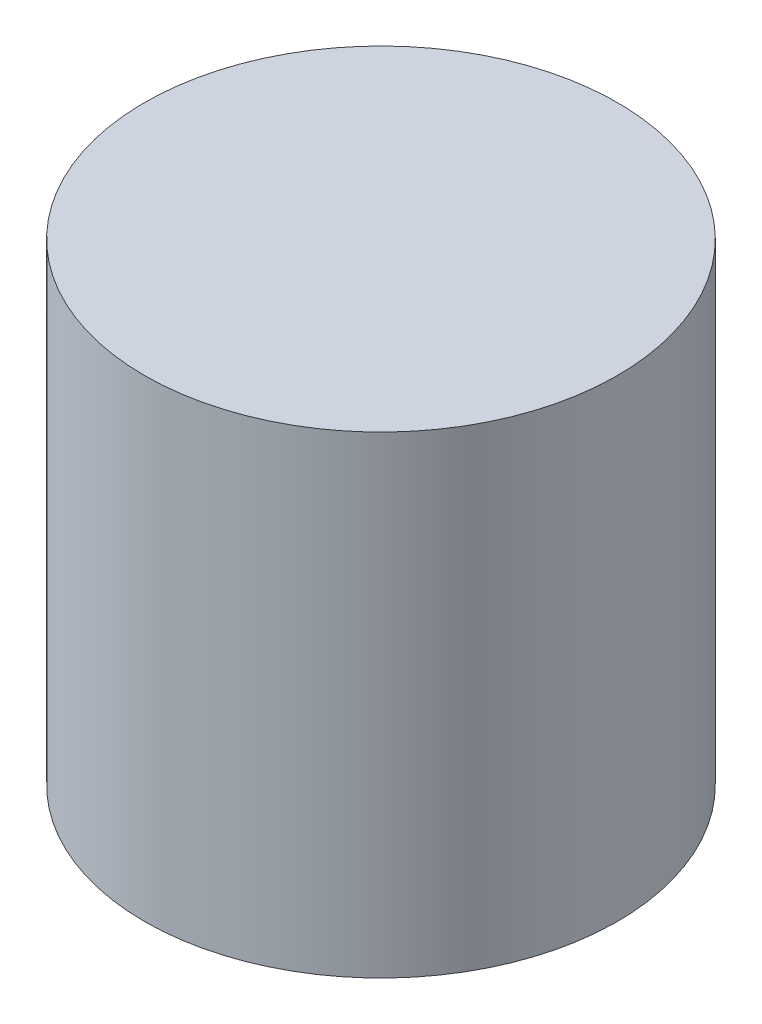
ISO-10303-21;
HEADER;
FILE_DESCRIPTION(('STEP AP214'),'2;1');
FILE_NAME('part.step','',(''),(''),'','','');
FILE_SCHEMA(('AUTOMOTIVE_DESIGN { 1 0 10303 214 1 1 1 1 }'));
ENDSEC;
DATA;
#1=APPLICATION_CONTEXT('core data for automotive mechanical design processes');
#2=APPLICATION_PROTOCOL_DEFINITION('international standard','automotive_design',2000,#1);
#3=PRODUCT_CONTEXT('',#1,'mechanical');
#4=PRODUCT('Part','Part','',(#3));
#5=PRODUCT_RELATED_PRODUCT_CATEGORY('part','',(#4));
#6=PRODUCT_DEFINITION_FORMATION('','',#4);
#7=PRODUCT_DEFINITION_CONTEXT('part definition',#1,'design');
#8=PRODUCT_DEFINITION('design','',#6,#7);
#9=PRODUCT_DEFINITION_SHAPE('','',#8);
#10=(LENGTH_UNIT() NAMED_UNIT(*) SI_UNIT(.MILLI.,.METRE.));
#11=(NAMED_UNIT(*) PLANE_ANGLE_UNIT() SI_UNIT($,.RADIAN.));
#12=(NAMED_UNIT(*) SI_UNIT($,.STERADIAN.) SOLID_ANGLE_UNIT());
#13=UNCERTAINTY_MEASURE_WITH_UNIT(LENGTH_MEASURE(1.E-05),#10,'distance_accuracy_value','');
#14=(GEOMETRIC_REPRESENTATION_CONTEXT(3) GLOBAL_UNCERTAINTY_ASSIGNED_CONTEXT((#13)) GLOBAL_UNIT_ASSIGNED_CONTEXT((#10,
#11,#12)) REPRESENTATION_CONTEXT('',''));
#15=CARTESIAN_POINT('',(0.,0.,0.));
#16=DIRECTION('',(0.,0.,1.));
#17=DIRECTION('',(1.,0.,0.));
#18=AXIS2_PLACEMENT_3D('',#15,#16,#17);
#19=CARTESIAN_POINT('',(0.,25.4,0.));
#20=DIRECTION('',(0.,-1.,0.));
#21=DIRECTION('',(0.,0.,-1.));
#22=AXIS2_PLACEMENT_3D('',#19,#20,#21);
#23=CYLINDRICAL_SURFACE('',#22,12.7);
#24=CARTESIAN_POINT('',(0.,25.4,0.));
#25=DIRECTION('',(0.,1.,0.));
#26=DIRECTION('',(0.,0.,1.));
#27=AXIS2_PLACEMENT_3D('',#24,#25,#26);
#28=CIRCLE('',#27,12.7);
#29=CARTESIAN_POINT('',(0.,25.4,12.7));
#30=VERTEX_POINT('',#29);
#31=EDGE_CURVE('E10',#30,#30,#28,.T.);
#32=ORIENTED_EDGE('',*,*,#31,.F.);
#33=EDGE_LOOP('',(#32));
#34=FACE_BOUND('',#33,.T.);
#35=CARTESIAN_POINT('',(0.,0.,0.));
#36=DIRECTION('',(0.,1.,0.));
#37=DIRECTION('',(0.,0.,1.));
#38=AXIS2_PLACEMENT_3D('',#35,#36,#37);
#39=CIRCLE('',#38,12.7);
#40=CARTESIAN_POINT('',(0.,0.,12.7));
#41=VERTEX_POINT('',#40);
#42=EDGE_CURVE('E34',#41,#41,#39,.T.);
#43=ORIENTED_EDGE('',*,*,#42,.T.);
#44=EDGE_LOOP('',(#43));
#45=FACE_BOUND('',#44,.T.);
#46=ADVANCED_FACE('F31',(#34,#45),#23,.T.);
#47=CARTESIAN_POINT('',(0.,25.4,0.));
#48=DIRECTION('',(0.,1.,0.));
#49=DIRECTION('',(0.,0.,1.));
#50=AXIS2_PLACEMENT_3D('',#47,#48,#49);
#51=PLANE('',#50);
#52=ORIENTED_EDGE('',*,*,#31,.T.);
#53=EDGE_LOOP('',(#52));
#54=FACE_BOUND('',#53,.T.);
#55=ADVANCED_FACE('F46',(#54),#51,.T.);
#56=CARTESIAN_POINT('',(0.,0.,0.));
#57=DIRECTION('',(0.,1.,0.));
#58=DIRECTION('',(0.,0.,1.));
#59=AXIS2_PLACEMENT_3D('',#56,#57,#58);
#60=PLANE('',#59);
#61=ORIENTED_EDGE('',*,*,#42,.F.);
#62=EDGE_LOOP('',(#61));
#63=FACE_BOUND('',#62,.T.);
#64=ADVANCED_FACE('F44',(#63),#60,.F.);
#65=CLOSED_SHELL('',(#46,#55,#64));
#66=MANIFOLD_SOLID_BREP('B2',#65);
#67=ADVANCED_BREP_SHAPE_REPRESENTATION('',(#18,#66),#14);
#68=SHAPE_DEFINITION_REPRESENTATION(#9,#67);
ENDSEC;
END-ISO-10303-21;
